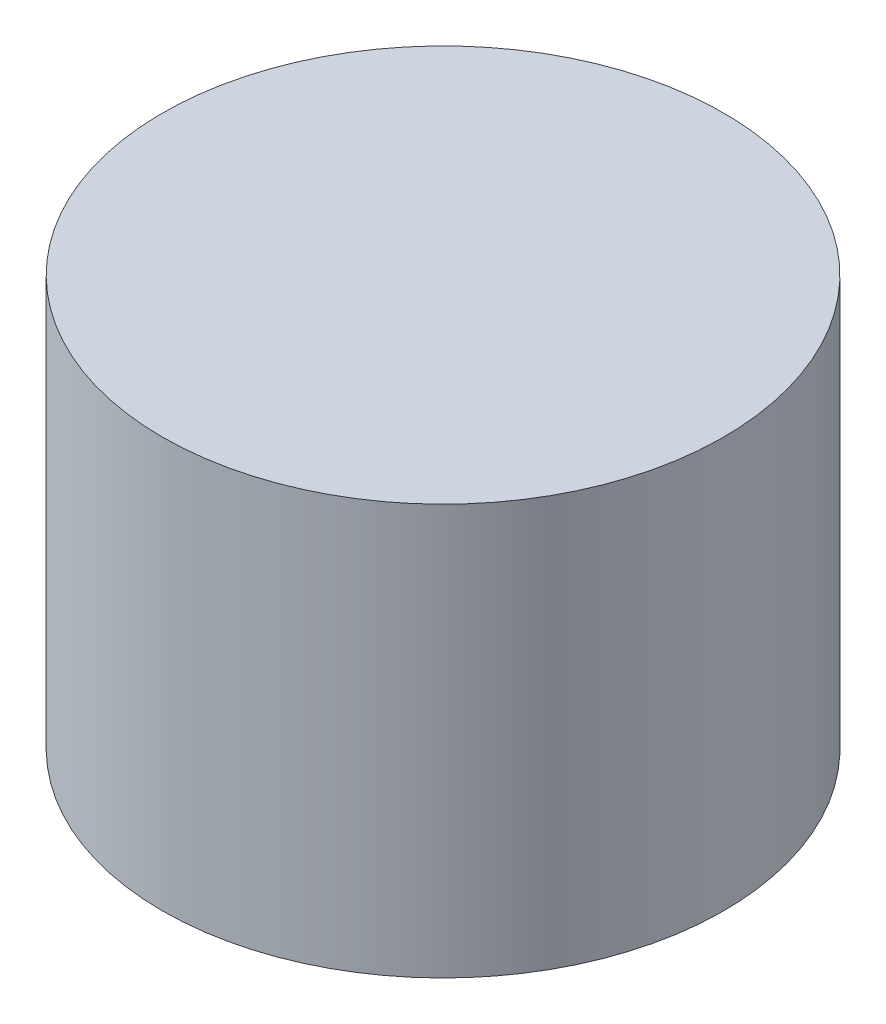
ISO-10303-21;
HEADER;
FILE_DESCRIPTION(('STEP AP214'),'2;1');
FILE_NAME('part.step','',(''),(''),'','','');
FILE_SCHEMA(('AUTOMOTIVE_DESIGN { 1 0 10303 214 1 1 1 1 }'));
ENDSEC;
DATA;
#1=APPLICATION_CONTEXT('core data for automotive mechanical design processes');
#2=APPLICATION_PROTOCOL_DEFINITION('international standard','automotive_design',2000,#1);
#3=PRODUCT_CONTEXT('',#1,'mechanical');
#4=PRODUCT('Part','Part','',(#3));
#5=PRODUCT_RELATED_PRODUCT_CATEGORY('part','',(#4));
#6=PRODUCT_DEFINITION_FORMATION('','',#4);
#7=PRODUCT_DEFINITION_CONTEXT('part definition',#1,'design');
#8=PRODUCT_DEFINITION('design','',#6,#7);
#9=PRODUCT_DEFINITION_SHAPE('','',#8);
#10=(LENGTH_UNIT() NAMED_UNIT(*) SI_UNIT(.MILLI.,.METRE.));
#11=(NAMED_UNIT(*) PLANE_ANGLE_UNIT() SI_UNIT($,.RADIAN.));
#12=(NAMED_UNIT(*) SI_UNIT($,.STERADIAN.) SOLID_ANGLE_UNIT());
#13=UNCERTAINTY_MEASURE_WITH_UNIT(LENGTH_MEASURE(1.E-05),#10,'distance_accuracy_value','');
#14=(GEOMETRIC_REPRESENTATION_CONTEXT(3) GLOBAL_UNCERTAINTY_ASSIGNED_CONTEXT((#13)) GLOBAL_UNIT_ASSIGNED_CONTEXT((#10,
#11,#12)) REPRESENTATION_CONTEXT('',''));
#15=CARTESIAN_POINT('',(0.,0.,0.));
#16=DIRECTION('',(0.,0.,1.));
#17=DIRECTION('',(1.,0.,0.));
#18=AXIS2_PLACEMENT_3D('',#15,#16,#17);
#19=CARTESIAN_POINT('',(0.,30.1752,0.));
#20=DIRECTION('',(0.,-1.,0.));
#21=DIRECTION('',(0.,0.,-1.));
#22=AXIS2_PLACEMENT_3D('',#19,#20,#21);
#23=CYLINDRICAL_SURFACE('',#22,20.6375);
#24=CARTESIAN_POINT('',(0.,30.1752,0.));
#25=DIRECTION('',(0.,1.,0.));
#26=DIRECTION('',(0.,0.,1.));
#27=AXIS2_PLACEMENT_3D('',#24,#25,#26);
#28=CIRCLE('',#27,20.6375);
#29=CARTESIAN_POINT('',(0.,30.1752,20.6375));
#30=VERTEX_POINT('',#29);
#31=EDGE_CURVE('E10',#30,#30,#28,.T.);
#32=ORIENTED_EDGE('',*,*,#31,.F.);
#33=EDGE_LOOP('',(#32));
#34=FACE_BOUND('',#33,.T.);
#35=CARTESIAN_POINT('',(0.,0.,0.));
#36=DIRECTION('',(0.,1.,0.));
#37=DIRECTION('',(0.,0.,1.));
#38=AXIS2_PLACEMENT_3D('',#35,#36,#37);
#39=CIRCLE('',#38,20.6375);
#40=CARTESIAN_POINT('',(0.,0.,20.6375));
#41=VERTEX_POINT('',#40);
#42=EDGE_CURVE('E42',#41,#41,#39,.T.);
#43=ORIENTED_EDGE('',*,*,#42,.T.);
#44=EDGE_LOOP('',(#43));
#45=FACE_BOUND('',#44,.T.);
#46=ADVANCED_FACE('F39',(#34,#45),#23,.T.);
#47=CARTESIAN_POINT('',(0.,30.1752,0.));
#48=DIRECTION('',(0.,1.,0.));
#49=DIRECTION('',(0.,0.,1.));
#50=AXIS2_PLACEMENT_3D('',#47,#48,#49);
#51=PLANE('',#50);
#52=ORIENTED_EDGE('',*,*,#31,.T.);
#53=EDGE_LOOP('',(#52));
#54=FACE_BOUND('',#53,.T.);
#55=ADVANCED_FACE('F54',(#54),#51,.T.);
#56=CARTESIAN_POINT('',(0.,0.,0.));
#57=DIRECTION('',(0.,1.,0.));
#58=DIRECTION('',(0.,0.,1.));
#59=AXIS2_PLACEMENT_3D('',#56,#57,#58);
#60=PLANE('',#59);
#61=ORIENTED_EDGE('',*,*,#42,.F.);
#62=EDGE_LOOP('',(#61));
#63=FACE_BOUND('',#62,.T.);
#64=ADVANCED_FACE('F52',(#63),#60,.F.);
#65=CLOSED_SHELL('',(#46,#55,#64));
#66=MANIFOLD_SOLID_BREP('B2',#65);
#67=ADVANCED_BREP_SHAPE_REPRESENTATION('',(#18,#66),#14);
#68=SHAPE_DEFINITION_REPRESENTATION(#9,#67);
ENDSEC;
END-ISO-10303-21;
